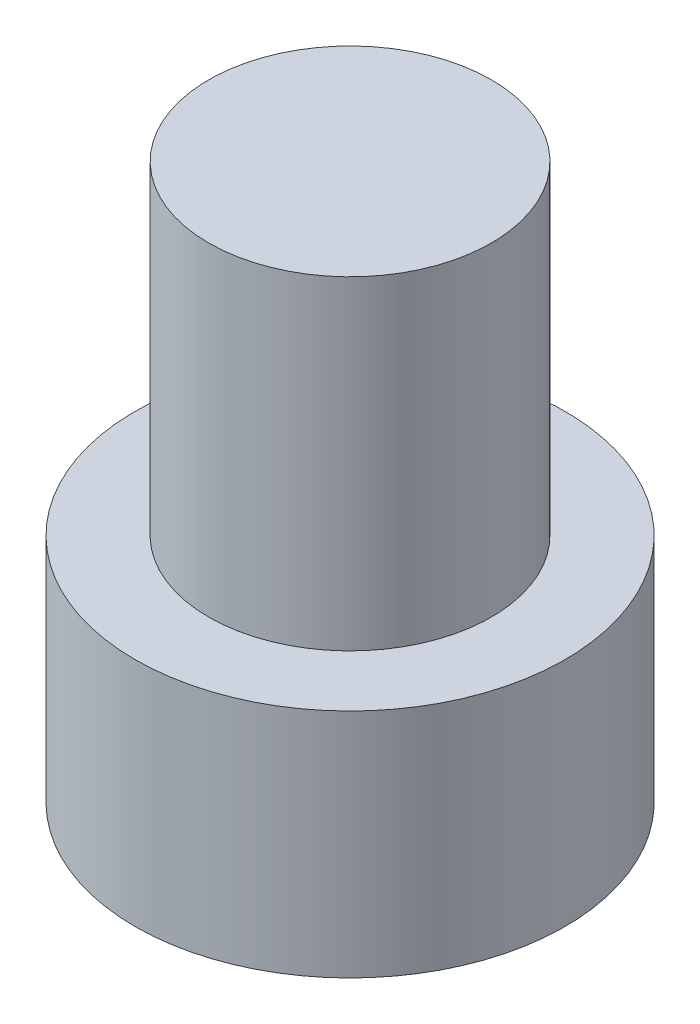
ISO-10303-21;
HEADER;
FILE_DESCRIPTION(('STEP AP214'),'2;1');
FILE_NAME('part.step','',(''),(''),'','','');
FILE_SCHEMA(('AUTOMOTIVE_DESIGN { 1 0 10303 214 1 1 1 1 }'));
ENDSEC;
DATA;
#1=APPLICATION_CONTEXT('core data for automotive mechanical design processes');
#2=APPLICATION_PROTOCOL_DEFINITION('international standard','automotive_design',2000,#1);
#3=PRODUCT_CONTEXT('',#1,'mechanical');
#4=PRODUCT('Part','Part','',(#3));
#5=PRODUCT_RELATED_PRODUCT_CATEGORY('part','',(#4));
#6=PRODUCT_DEFINITION_FORMATION('','',#4);
#7=PRODUCT_DEFINITION_CONTEXT('part definition',#1,'design');
#8=PRODUCT_DEFINITION('design','',#6,#7);
#9=PRODUCT_DEFINITION_SHAPE('','',#8);
#10=(LENGTH_UNIT() NAMED_UNIT(*) SI_UNIT(.MILLI.,.METRE.));
#11=(NAMED_UNIT(*) PLANE_ANGLE_UNIT() SI_UNIT($,.RADIAN.));
#12=(NAMED_UNIT(*) SI_UNIT($,.STERADIAN.) SOLID_ANGLE_UNIT());
#13=UNCERTAINTY_MEASURE_WITH_UNIT(LENGTH_MEASURE(1.E-05),#10,'distance_accuracy_value','');
#14=(GEOMETRIC_REPRESENTATION_CONTEXT(3) GLOBAL_UNCERTAINTY_ASSIGNED_CONTEXT((#13)) GLOBAL_UNIT_ASSIGNED_CONTEXT((#10,
#11,#12)) REPRESENTATION_CONTEXT('',''));
#15=CARTESIAN_POINT('',(0.,0.,0.));
#16=DIRECTION('',(0.,0.,1.));
#17=DIRECTION('',(1.,0.,0.));
#18=AXIS2_PLACEMENT_3D('',#15,#16,#17);
#19=CARTESIAN_POINT('',(0.,7.85,0.));
#20=DIRECTION('',(0.,1.,0.));
#21=DIRECTION('',(0.,0.,1.));
#22=AXIS2_PLACEMENT_3D('',#19,#20,#21);
#23=PLANE('',#22);
#24=CARTESIAN_POINT('',(0.,7.85,0.));
#25=DIRECTION('',(0.,1.,0.));
#26=DIRECTION('',(0.,0.,1.));
#27=AXIS2_PLACEMENT_3D('',#24,#25,#26);
#28=CIRCLE('',#27,7.3);
#29=CARTESIAN_POINT('',(0.,7.85,7.3));
#30=VERTEX_POINT('',#29);
#31=EDGE_CURVE('E10',#30,#30,#28,.T.);
#32=ORIENTED_EDGE('',*,*,#31,.T.);
#33=EDGE_LOOP('',(#32));
#34=FACE_BOUND('',#33,.T.);
#35=CARTESIAN_POINT('',(0.,7.85,0.));
#36=DIRECTION('',(0.,1.,0.));
#37=DIRECTION('',(0.,0.,1.));
#38=AXIS2_PLACEMENT_3D('',#35,#36,#37);
#39=CIRCLE('',#38,4.8);
#40=CARTESIAN_POINT('',(0.,7.85,4.8));
#41=VERTEX_POINT('',#40);
#42=EDGE_CURVE('E44',#41,#41,#39,.T.);
#43=ORIENTED_EDGE('',*,*,#42,.F.);
#44=EDGE_LOOP('',(#43));
#45=FACE_BOUND('',#44,.T.);
#46=ADVANCED_FACE('F31',(#34,#45),#23,.T.);
#47=CARTESIAN_POINT('',(0.,7.85,0.));
#48=DIRECTION('',(0.,-1.,0.));
#49=DIRECTION('',(0.,0.,-1.));
#50=AXIS2_PLACEMENT_3D('',#47,#48,#49);
#51=CYLINDRICAL_SURFACE('',#50,7.3);
#52=ORIENTED_EDGE('',*,*,#31,.F.);
#53=EDGE_LOOP('',(#52));
#54=FACE_BOUND('',#53,.T.);
#55=CARTESIAN_POINT('',(0.,0.,0.));
#56=DIRECTION('',(0.,1.,0.));
#57=DIRECTION('',(0.,0.,1.));
#58=AXIS2_PLACEMENT_3D('',#55,#56,#57);
#59=CIRCLE('',#58,7.3);
#60=CARTESIAN_POINT('',(0.,0.,7.3));
#61=VERTEX_POINT('',#60);
#62=EDGE_CURVE('E35',#61,#61,#59,.T.);
#63=ORIENTED_EDGE('',*,*,#62,.T.);
#64=EDGE_LOOP('',(#63));
#65=FACE_BOUND('',#64,.T.);
#66=ADVANCED_FACE('F33',(#54,#65),#51,.T.);
#67=CARTESIAN_POINT('',(0.,0.,0.));
#68=DIRECTION('',(0.,1.,0.));
#69=DIRECTION('',(0.,0.,1.));
#70=AXIS2_PLACEMENT_3D('',#67,#68,#69);
#71=PLANE('',#70);
#72=ORIENTED_EDGE('',*,*,#62,.F.);
#73=EDGE_LOOP('',(#72));
#74=FACE_BOUND('',#73,.T.);
#75=ADVANCED_FACE('F55',(#74),#71,.F.);
#76=CARTESIAN_POINT('',(0.,18.85,0.));
#77=DIRECTION('',(0.,-1.,0.));
#78=DIRECTION('',(0.,0.,-1.));
#79=AXIS2_PLACEMENT_3D('',#76,#77,#78);
#80=CYLINDRICAL_SURFACE('',#79,4.8);
#81=CARTESIAN_POINT('',(0.,18.85,0.));
#82=DIRECTION('',(0.,1.,0.));
#83=DIRECTION('',(0.,0.,1.));
#84=AXIS2_PLACEMENT_3D('',#81,#82,#83);
#85=CIRCLE('',#84,4.8);
#86=CARTESIAN_POINT('',(0.,18.85,4.8));
#87=VERTEX_POINT('',#86);
#88=EDGE_CURVE('E42',#87,#87,#85,.T.);
#89=ORIENTED_EDGE('',*,*,#88,.F.);
#90=EDGE_LOOP('',(#89));
#91=FACE_BOUND('',#90,.T.);
#92=ORIENTED_EDGE('',*,*,#42,.T.);
#93=EDGE_LOOP('',(#92));
#94=FACE_BOUND('',#93,.T.);
#95=ADVANCED_FACE('F52',(#91,#94),#80,.T.);
#96=CARTESIAN_POINT('',(0.,18.85,0.));
#97=DIRECTION('',(0.,1.,0.));
#98=DIRECTION('',(0.,0.,1.));
#99=AXIS2_PLACEMENT_3D('',#96,#97,#98);
#100=PLANE('',#99);
#101=ORIENTED_EDGE('',*,*,#88,.T.);
#102=EDGE_LOOP('',(#101));
#103=FACE_BOUND('',#102,.T.);
#104=ADVANCED_FACE('F50',(#103),#100,.T.);
#105=CLOSED_SHELL('',(#46,#66,#75,#95,#104));
#106=MANIFOLD_SOLID_BREP('B2',#105);
#107=ADVANCED_BREP_SHAPE_REPRESENTATION('',(#18,#106),#14);
#108=SHAPE_DEFINITION_REPRESENTATION(#9,#107);
ENDSEC;
END-ISO-10303-21;
